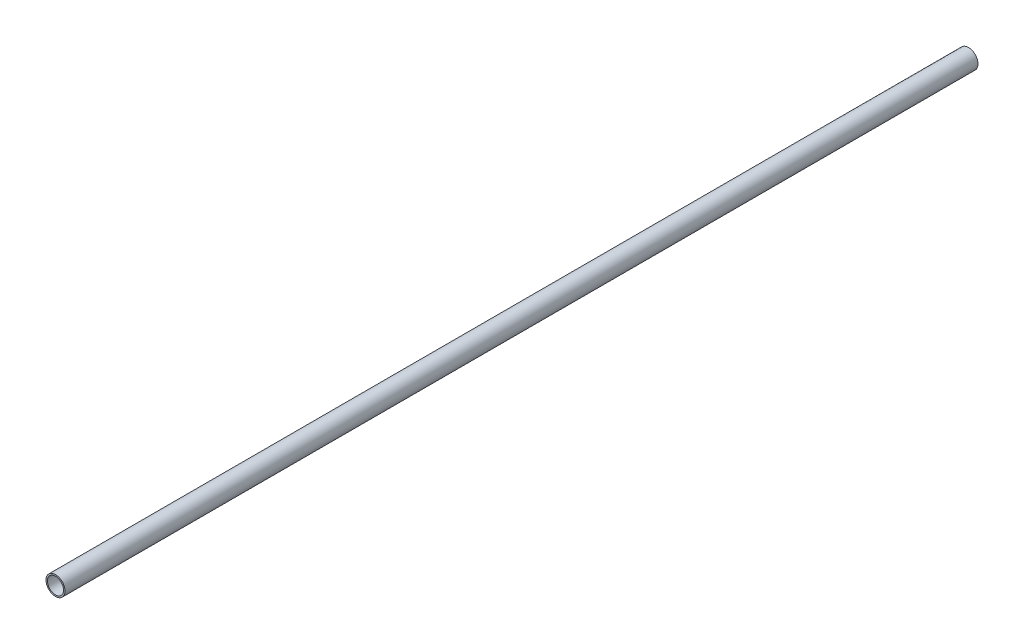
ISO-10303-21;
HEADER;
FILE_DESCRIPTION(('STEP AP214'),'2;1');
FILE_NAME('part.step','',(''),(''),'','','');
FILE_SCHEMA(('AUTOMOTIVE_DESIGN { 1 0 10303 214 1 1 1 1 }'));
ENDSEC;
DATA;
#1=APPLICATION_CONTEXT('core data for automotive mechanical design processes');
#2=APPLICATION_PROTOCOL_DEFINITION('international standard','automotive_design',2000,#1);
#3=PRODUCT_CONTEXT('',#1,'mechanical');
#4=PRODUCT('Part','Part','',(#3));
#5=PRODUCT_RELATED_PRODUCT_CATEGORY('part','',(#4));
#6=PRODUCT_DEFINITION_FORMATION('','',#4);
#7=PRODUCT_DEFINITION_CONTEXT('part definition',#1,'design');
#8=PRODUCT_DEFINITION('design','',#6,#7);
#9=PRODUCT_DEFINITION_SHAPE('','',#8);
#10=(LENGTH_UNIT() NAMED_UNIT(*) SI_UNIT(.MILLI.,.METRE.));
#11=(NAMED_UNIT(*) PLANE_ANGLE_UNIT() SI_UNIT($,.RADIAN.));
#12=(NAMED_UNIT(*) SI_UNIT($,.STERADIAN.) SOLID_ANGLE_UNIT());
#13=UNCERTAINTY_MEASURE_WITH_UNIT(LENGTH_MEASURE(1.E-05),#10,'distance_accuracy_value','');
#14=(GEOMETRIC_REPRESENTATION_CONTEXT(3) GLOBAL_UNCERTAINTY_ASSIGNED_CONTEXT((#13)) GLOBAL_UNIT_ASSIGNED_CONTEXT((#10,
#11,#12)) REPRESENTATION_CONTEXT('',''));
#15=CARTESIAN_POINT('',(0.,0.,0.));
#16=DIRECTION('',(0.,0.,1.));
#17=DIRECTION('',(1.,0.,0.));
#18=AXIS2_PLACEMENT_3D('',#15,#16,#17);
#19=CARTESIAN_POINT('',(0.,0.,5486.4));
#20=DIRECTION('',(0.,0.,1.));
#21=DIRECTION('',(1.,0.,0.));
#22=AXIS2_PLACEMENT_3D('',#19,#20,#21);
#23=PLANE('',#22);
#24=CARTESIAN_POINT('',(0.,0.,5486.4));
#25=DIRECTION('',(0.,0.,1.));
#26=DIRECTION('',(1.,0.,0.));
#27=AXIS2_PLACEMENT_3D('',#24,#25,#26);
#28=CIRCLE('',#27,57.15);
#29=CARTESIAN_POINT('',(57.15,0.,5486.4));
#30=VERTEX_POINT('',#29);
#31=EDGE_CURVE('E10',#30,#30,#28,.T.);
#32=ORIENTED_EDGE('',*,*,#31,.T.);
#33=EDGE_LOOP('',(#32));
#34=FACE_BOUND('',#33,.T.);
#35=CARTESIAN_POINT('',(0.,0.,5486.4));
#36=DIRECTION('',(0.,0.,1.));
#37=DIRECTION('',(1.,0.,0.));
#38=AXIS2_PLACEMENT_3D('',#35,#36,#37);
#39=CIRCLE('',#38,48.5902);
#40=CARTESIAN_POINT('',(48.5902,0.,5486.4));
#41=VERTEX_POINT('',#40);
#42=EDGE_CURVE('E39',#41,#41,#39,.T.);
#43=ORIENTED_EDGE('',*,*,#42,.F.);
#44=EDGE_LOOP('',(#43));
#45=FACE_BOUND('',#44,.T.);
#46=ADVANCED_FACE('F28',(#34,#45),#23,.T.);
#47=CARTESIAN_POINT('',(0.,0.,0.));
#48=DIRECTION('',(0.,0.,1.));
#49=DIRECTION('',(1.,0.,0.));
#50=AXIS2_PLACEMENT_3D('',#47,#48,#49);
#51=PLANE('',#50);
#52=CARTESIAN_POINT('',(0.,0.,0.));
#53=DIRECTION('',(0.,0.,1.));
#54=DIRECTION('',(1.,0.,0.));
#55=AXIS2_PLACEMENT_3D('',#52,#53,#54);
#56=CIRCLE('',#55,57.15);
#57=CARTESIAN_POINT('',(57.15,0.,0.));
#58=VERTEX_POINT('',#57);
#59=EDGE_CURVE('E32',#58,#58,#56,.T.);
#60=ORIENTED_EDGE('',*,*,#59,.F.);
#61=EDGE_LOOP('',(#60));
#62=FACE_BOUND('',#61,.T.);
#63=CARTESIAN_POINT('',(0.,0.,0.));
#64=DIRECTION('',(0.,0.,1.));
#65=DIRECTION('',(1.,0.,0.));
#66=AXIS2_PLACEMENT_3D('',#63,#64,#65);
#67=CIRCLE('',#66,48.5902);
#68=CARTESIAN_POINT('',(48.5902,0.,0.));
#69=VERTEX_POINT('',#68);
#70=EDGE_CURVE('E41',#69,#69,#67,.T.);
#71=ORIENTED_EDGE('',*,*,#70,.T.);
#72=EDGE_LOOP('',(#71));
#73=FACE_BOUND('',#72,.T.);
#74=ADVANCED_FACE('F51',(#62,#73),#51,.F.);
#75=CARTESIAN_POINT('',(0.,0.,5486.4));
#76=DIRECTION('',(0.,0.,-1.));
#77=DIRECTION('',(-1.,0.,0.));
#78=AXIS2_PLACEMENT_3D('',#75,#76,#77);
#79=CYLINDRICAL_SURFACE('',#78,57.15);
#80=ORIENTED_EDGE('',*,*,#31,.F.);
#81=EDGE_LOOP('',(#80));
#82=FACE_BOUND('',#81,.T.);
#83=ORIENTED_EDGE('',*,*,#59,.T.);
#84=EDGE_LOOP('',(#83));
#85=FACE_BOUND('',#84,.T.);
#86=ADVANCED_FACE('F30',(#82,#85),#79,.T.);
#87=CARTESIAN_POINT('',(0.,0.,5486.4));
#88=DIRECTION('',(0.,0.,-1.));
#89=DIRECTION('',(-1.,0.,0.));
#90=AXIS2_PLACEMENT_3D('',#87,#88,#89);
#91=CYLINDRICAL_SURFACE('',#90,48.5902);
#92=ORIENTED_EDGE('',*,*,#42,.T.);
#93=EDGE_LOOP('',(#92));
#94=FACE_BOUND('',#93,.T.);
#95=ORIENTED_EDGE('',*,*,#70,.F.);
#96=EDGE_LOOP('',(#95));
#97=FACE_BOUND('',#96,.T.);
#98=ADVANCED_FACE('F47',(#94,#97),#91,.F.);
#99=CLOSED_SHELL('',(#46,#74,#86,#98));
#100=MANIFOLD_SOLID_BREP('B2',#99);
#101=ADVANCED_BREP_SHAPE_REPRESENTATION('',(#18,#100),#14);
#102=SHAPE_DEFINITION_REPRESENTATION(#9,#101);
ENDSEC;
END-ISO-10303-21;
